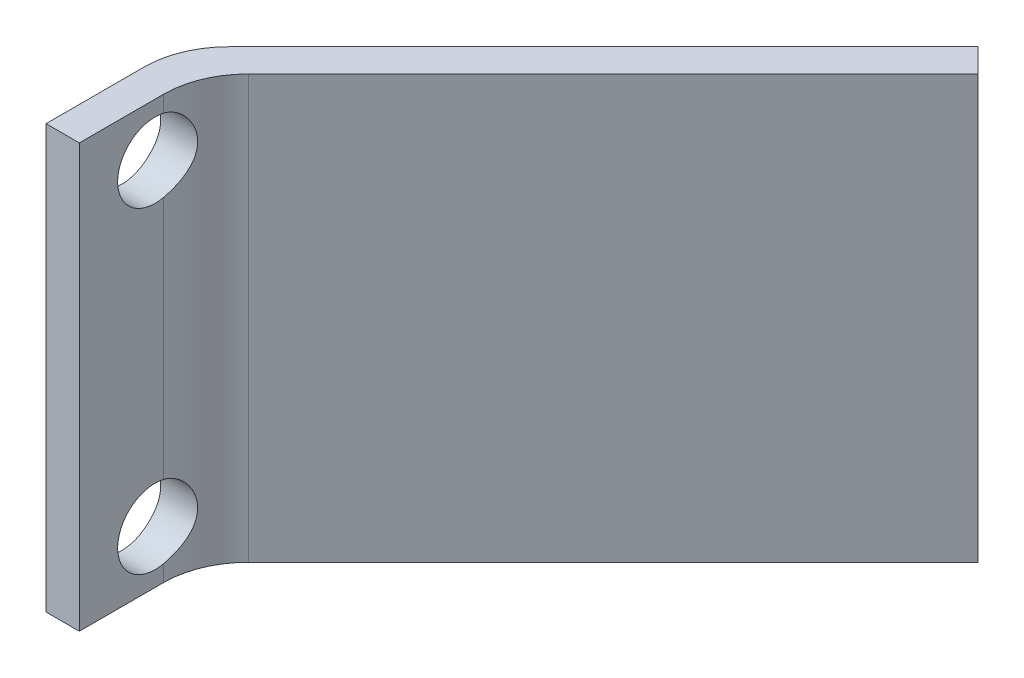
ISO-10303-21;
HEADER;
FILE_DESCRIPTION(('STEP AP214'),'2;1');
FILE_NAME('part.step','',(''),(''),'','','');
FILE_SCHEMA(('AUTOMOTIVE_DESIGN { 1 0 10303 214 1 1 1 1 }'));
ENDSEC;
DATA;
#1=APPLICATION_CONTEXT('core data for automotive mechanical design processes');
#2=APPLICATION_PROTOCOL_DEFINITION('international standard','automotive_design',2000,#1);
#3=PRODUCT_CONTEXT('',#1,'mechanical');
#4=PRODUCT('Part','Part','',(#3));
#5=PRODUCT_RELATED_PRODUCT_CATEGORY('part','',(#4));
#6=PRODUCT_DEFINITION_FORMATION('','',#4);
#7=PRODUCT_DEFINITION_CONTEXT('part definition',#1,'design');
#8=PRODUCT_DEFINITION('design','',#6,#7);
#9=PRODUCT_DEFINITION_SHAPE('','',#8);
#10=(LENGTH_UNIT() NAMED_UNIT(*) SI_UNIT(.MILLI.,.METRE.));
#11=(NAMED_UNIT(*) PLANE_ANGLE_UNIT() SI_UNIT($,.RADIAN.));
#12=(NAMED_UNIT(*) SI_UNIT($,.STERADIAN.) SOLID_ANGLE_UNIT());
#13=UNCERTAINTY_MEASURE_WITH_UNIT(LENGTH_MEASURE(1.E-05),#10,'distance_accuracy_value','');
#14=(GEOMETRIC_REPRESENTATION_CONTEXT(3) GLOBAL_UNCERTAINTY_ASSIGNED_CONTEXT((#13)) GLOBAL_UNIT_ASSIGNED_CONTEXT((#10,
#11,#12)) REPRESENTATION_CONTEXT('',''));
#15=CARTESIAN_POINT('',(0.,0.,0.));
#16=DIRECTION('',(0.,0.,1.));
#17=DIRECTION('',(1.,0.,0.));
#18=AXIS2_PLACEMENT_3D('',#15,#16,#17);
#19=CARTESIAN_POINT('',(1.,12.7,0.));
#20=DIRECTION('',(-1.,0.,0.));
#21=DIRECTION('',(0.,0.,1.));
#22=AXIS2_PLACEMENT_3D('',#19,#20,#21);
#23=PLANE('',#22);
#24=DIRECTION('',(0.,-1.,0.));
#25=VECTOR('',#24,1.);
#26=CARTESIAN_POINT('',(1.,12.7,-2.53368398919926));
#27=LINE('',#26,#25);
#28=CARTESIAN_POINT('',(1.,2.6827770228739,-2.53368398919926));
#29=VERTEX_POINT('',#28);
#30=CARTESIAN_POINT('',(1.,10.0172229771261,-2.53368398919926));
#31=VERTEX_POINT('',#30);
#32=EDGE_CURVE('E170',#29,#31,#27,.F.);
#33=ORIENTED_EDGE('',*,*,#32,.T.);
#34=CARTESIAN_POINT('',(1.,11.1125,-2.27679248843583));
#35=DIRECTION('',(-1.,0.,0.));
#36=DIRECTION('',(0.,0.,1.));
#37=AXIS2_PLACEMENT_3D('',#34,#35,#36);
#38=CIRCLE('',#37,1.125);
#39=CARTESIAN_POINT('',(1.,12.2077770228739,-2.53368398919926));
#40=VERTEX_POINT('',#39);
#41=EDGE_CURVE('E131',#31,#40,#38,.T.);
#42=ORIENTED_EDGE('',*,*,#41,.T.);
#43=CARTESIAN_POINT('',(1.,12.7,-2.53368398919926));
#44=VERTEX_POINT('',#43);
#45=EDGE_CURVE('E165',#40,#44,#27,.F.);
#46=ORIENTED_EDGE('',*,*,#45,.T.);
#47=DIRECTION('',(0.,0.,-1.));
#48=VECTOR('',#47,1.);
#49=CARTESIAN_POINT('',(1.,12.7,0.));
#50=LINE('',#49,#48);
#51=CARTESIAN_POINT('',(1.,12.7,0.));
#52=VERTEX_POINT('',#51);
#53=EDGE_CURVE('E229',#52,#44,#50,.T.);
#54=ORIENTED_EDGE('',*,*,#53,.F.);
#55=DIRECTION('',(0.,-1.,0.));
#56=VECTOR('',#55,1.);
#57=CARTESIAN_POINT('',(1.,12.7,0.));
#58=LINE('',#57,#56);
#59=CARTESIAN_POINT('',(1.,0.,0.));
#60=VERTEX_POINT('',#59);
#61=EDGE_CURVE('E145',#52,#60,#58,.T.);
#62=ORIENTED_EDGE('',*,*,#61,.T.);
#63=DIRECTION('',(0.,0.,-1.));
#64=VECTOR('',#63,1.);
#65=CARTESIAN_POINT('',(1.,0.,0.));
#66=LINE('',#65,#64);
#67=CARTESIAN_POINT('',(1.,0.,-2.53368398919926));
#68=VERTEX_POINT('',#67);
#69=EDGE_CURVE('E237',#60,#68,#66,.T.);
#70=ORIENTED_EDGE('',*,*,#69,.T.);
#71=CARTESIAN_POINT('',(1.,0.492222977126097,-2.53368398919926));
#72=VERTEX_POINT('',#71);
#73=EDGE_CURVE('E166',#68,#72,#27,.F.);
#74=ORIENTED_EDGE('',*,*,#73,.T.);
#75=CARTESIAN_POINT('',(1.,1.5875,-2.27679248843583));
#76=DIRECTION('',(-1.,0.,0.));
#77=DIRECTION('',(0.,0.,1.));
#78=AXIS2_PLACEMENT_3D('',#75,#76,#77);
#79=CIRCLE('',#78,1.125);
#80=EDGE_CURVE('E132',#72,#29,#79,.T.);
#81=ORIENTED_EDGE('',*,*,#80,.T.);
#82=EDGE_LOOP('',(#33,#42,#46,#54,#62,#70,#74,#81));
#83=FACE_BOUND('',#82,.T.);
#84=ADVANCED_FACE('F33',(#83),#23,.F.);
#85=CARTESIAN_POINT('',(0.,12.7,0.));
#86=DIRECTION('',(0.,0.,-1.));
#87=DIRECTION('',(-1.,0.,0.));
#88=AXIS2_PLACEMENT_3D('',#85,#86,#87);
#89=PLANE('',#88);
#90=DIRECTION('',(1.,0.,0.));
#91=VECTOR('',#90,1.);
#92=CARTESIAN_POINT('',(0.,0.,0.));
#93=LINE('',#92,#91);
#94=CARTESIAN_POINT('',(0.,0.,0.));
#95=VERTEX_POINT('',#94);
#96=EDGE_CURVE('E218',#95,#60,#93,.T.);
#97=ORIENTED_EDGE('',*,*,#96,.T.);
#98=ORIENTED_EDGE('',*,*,#61,.F.);
#99=DIRECTION('',(1.,0.,0.));
#100=VECTOR('',#99,1.);
#101=CARTESIAN_POINT('',(0.,12.7,0.));
#102=LINE('',#101,#100);
#103=CARTESIAN_POINT('',(0.,12.7,0.));
#104=VERTEX_POINT('',#103);
#105=EDGE_CURVE('E226',#104,#52,#102,.T.);
#106=ORIENTED_EDGE('',*,*,#105,.F.);
#107=DIRECTION('',(0.,-1.,0.));
#108=VECTOR('',#107,1.);
#109=CARTESIAN_POINT('',(0.,12.7,0.));
#110=LINE('',#109,#108);
#111=EDGE_CURVE('E149',#104,#95,#110,.T.);
#112=ORIENTED_EDGE('',*,*,#111,.T.);
#113=EDGE_LOOP('',(#97,#98,#106,#112));
#114=FACE_BOUND('',#113,.T.);
#115=ADVANCED_FACE('F196',(#114),#89,.F.);
#116=CARTESIAN_POINT('',(0.,12.7,0.));
#117=DIRECTION('',(1.,0.,0.));
#118=DIRECTION('',(0.,0.,-1.));
#119=AXIS2_PLACEMENT_3D('',#116,#117,#118);
#120=PLANE('',#119);
#121=DIRECTION('',(0.,-1.,0.));
#122=VECTOR('',#121,1.);
#123=CARTESIAN_POINT('',(0.,12.7,-2.94789755157235));
#124=LINE('',#123,#122);
#125=CARTESIAN_POINT('',(0.,12.7,-2.94789755157235));
#126=VERTEX_POINT('',#125);
#127=CARTESIAN_POINT('',(0.,12.0154080762916,-2.94789755157235));
#128=VERTEX_POINT('',#127);
#129=EDGE_CURVE('E147',#126,#128,#124,.T.);
#130=ORIENTED_EDGE('',*,*,#129,.T.);
#131=CARTESIAN_POINT('',(0.,11.1125,-2.27679248843583));
#132=DIRECTION('',(1.,0.,0.));
#133=DIRECTION('',(0.,0.,-1.));
#134=AXIS2_PLACEMENT_3D('',#131,#132,#133);
#135=CIRCLE('',#134,1.125);
#136=CARTESIAN_POINT('',(0.,10.2095919237084,-2.94789755157235));
#137=VERTEX_POINT('',#136);
#138=EDGE_CURVE('E59',#128,#137,#135,.T.);
#139=ORIENTED_EDGE('',*,*,#138,.T.);
#140=CARTESIAN_POINT('',(0.,2.49040807629157,-2.94789755157235));
#141=VERTEX_POINT('',#140);
#142=EDGE_CURVE('E139',#137,#141,#124,.T.);
#143=ORIENTED_EDGE('',*,*,#142,.T.);
#144=CARTESIAN_POINT('',(0.,1.5875,-2.27679248843583));
#145=DIRECTION('',(1.,0.,0.));
#146=DIRECTION('',(0.,0.,-1.));
#147=AXIS2_PLACEMENT_3D('',#144,#145,#146);
#148=CIRCLE('',#147,1.125);
#149=CARTESIAN_POINT('',(0.,0.684591923708432,-2.94789755157235));
#150=VERTEX_POINT('',#149);
#151=EDGE_CURVE('E52',#141,#150,#148,.T.);
#152=ORIENTED_EDGE('',*,*,#151,.T.);
#153=CARTESIAN_POINT('',(0.,0.,-2.94789755157235));
#154=VERTEX_POINT('',#153);
#155=EDGE_CURVE('E137',#150,#154,#124,.T.);
#156=ORIENTED_EDGE('',*,*,#155,.T.);
#157=DIRECTION('',(0.,0.,1.));
#158=VECTOR('',#157,1.);
#159=CARTESIAN_POINT('',(0.,0.,0.));
#160=LINE('',#159,#158);
#161=EDGE_CURVE('E230',#154,#95,#160,.T.);
#162=ORIENTED_EDGE('',*,*,#161,.T.);
#163=ORIENTED_EDGE('',*,*,#111,.F.);
#164=DIRECTION('',(0.,0.,1.));
#165=VECTOR('',#164,1.);
#166=CARTESIAN_POINT('',(0.,12.7,0.));
#167=LINE('',#166,#165);
#168=EDGE_CURVE('E233',#126,#104,#167,.T.);
#169=ORIENTED_EDGE('',*,*,#168,.F.);
#170=EDGE_LOOP('',(#130,#139,#143,#152,#156,#162,#163,#169));
#171=FACE_BOUND('',#170,.T.);
#172=ADVANCED_FACE('F136',(#171),#120,.F.);
#173=CARTESIAN_POINT('',(0.,12.7,0.));
#174=DIRECTION('',(0.,1.,0.));
#175=DIRECTION('',(0.,0.,1.));
#176=AXIS2_PLACEMENT_3D('',#173,#174,#175);
#177=PLANE('',#176);
#178=DIRECTION('',(-0.707106781186543,0.,0.707106781186552));
#179=VECTOR('',#178,1.);
#180=CARTESIAN_POINT('',(0.,12.7,-4.));
#181=LINE('',#180,#179);
#182=CARTESIAN_POINT('',(11.9928932188134,12.7,-15.9928932188136));
#183=VERTEX_POINT('',#182);
#184=CARTESIAN_POINT('',(0.743948775786159,12.7,-4.74394877578617));
#185=VERTEX_POINT('',#184);
#186=EDGE_CURVE('E208',#183,#185,#181,.T.);
#187=ORIENTED_EDGE('',*,*,#186,.T.);
#188=CARTESIAN_POINT('',(2.54,12.7,-2.94789755157235));
#189=DIRECTION('',(0.,1.,0.));
#190=DIRECTION('',(0.,0.,1.));
#191=AXIS2_PLACEMENT_3D('',#188,#189,#190);
#192=CIRCLE('',#191,2.54);
#193=EDGE_CURVE('E158',#185,#126,#192,.T.);
#194=ORIENTED_EDGE('',*,*,#193,.T.);
#195=ORIENTED_EDGE('',*,*,#168,.T.);
#196=ORIENTED_EDGE('',*,*,#105,.T.);
#197=ORIENTED_EDGE('',*,*,#53,.T.);
#198=CARTESIAN_POINT('',(3.54,12.7,-2.53368398919926));
#199=DIRECTION('',(0.,1.,0.));
#200=DIRECTION('',(0.,0.,1.));
#201=AXIS2_PLACEMENT_3D('',#198,#199,#200);
#202=CIRCLE('',#201,2.54);
#203=CARTESIAN_POINT('',(1.74394877578616,12.7,-4.32973521341308));
#204=VERTEX_POINT('',#203);
#205=EDGE_CURVE('E172',#44,#204,#202,.F.);
#206=ORIENTED_EDGE('',*,*,#205,.T.);
#207=DIRECTION('',(0.707106781186543,0.,-0.707106781186552));
#208=VECTOR('',#207,1.);
#209=CARTESIAN_POINT('',(0.707106781186552,12.7,-3.29289321881346));
#210=LINE('',#209,#208);
#211=CARTESIAN_POINT('',(12.7,12.7,-15.285786437627));
#212=VERTEX_POINT('',#211);
#213=EDGE_CURVE('E219',#204,#212,#210,.T.);
#214=ORIENTED_EDGE('',*,*,#213,.T.);
#215=DIRECTION('',(-0.707106781186551,0.,-0.707106781186544));
#216=VECTOR('',#215,1.);
#217=CARTESIAN_POINT('',(11.9928932188134,12.7,-15.9928932188136));
#218=LINE('',#217,#216);
#219=EDGE_CURVE('E215',#212,#183,#218,.T.);
#220=ORIENTED_EDGE('',*,*,#219,.T.);
#221=EDGE_LOOP('',(#187,#194,#195,#196,#197,#206,#214,#220));
#222=FACE_BOUND('',#221,.T.);
#223=ADVANCED_FACE('F256',(#222),#177,.T.);
#224=CARTESIAN_POINT('',(0.,0.,0.));
#225=DIRECTION('',(0.,1.,0.));
#226=DIRECTION('',(0.,0.,1.));
#227=AXIS2_PLACEMENT_3D('',#224,#225,#226);
#228=PLANE('',#227);
#229=ORIENTED_EDGE('',*,*,#161,.F.);
#230=CARTESIAN_POINT('',(2.54,0.,-2.94789755157235));
#231=DIRECTION('',(0.,1.,0.));
#232=DIRECTION('',(0.,0.,1.));
#233=AXIS2_PLACEMENT_3D('',#230,#231,#232);
#234=CIRCLE('',#233,2.54);
#235=CARTESIAN_POINT('',(0.743948775786159,0.,-4.74394877578617));
#236=VERTEX_POINT('',#235);
#237=EDGE_CURVE('E143',#154,#236,#234,.F.);
#238=ORIENTED_EDGE('',*,*,#237,.T.);
#239=DIRECTION('',(-0.707106781186543,0.,0.707106781186552));
#240=VECTOR('',#239,1.);
#241=CARTESIAN_POINT('',(0.,0.,-4.));
#242=LINE('',#241,#240);
#243=CARTESIAN_POINT('',(11.9928932188134,0.,-15.9928932188136));
#244=VERTEX_POINT('',#243);
#245=EDGE_CURVE('E206',#244,#236,#242,.T.);
#246=ORIENTED_EDGE('',*,*,#245,.F.);
#247=DIRECTION('',(-0.707106781186551,0.,-0.707106781186544));
#248=VECTOR('',#247,1.);
#249=CARTESIAN_POINT('',(11.9928932188134,0.,-15.9928932188136));
#250=LINE('',#249,#248);
#251=CARTESIAN_POINT('',(12.7,0.,-15.285786437627));
#252=VERTEX_POINT('',#251);
#253=EDGE_CURVE('E210',#252,#244,#250,.T.);
#254=ORIENTED_EDGE('',*,*,#253,.F.);
#255=DIRECTION('',(0.707106781186543,0.,-0.707106781186552));
#256=VECTOR('',#255,1.);
#257=CARTESIAN_POINT('',(0.707106781186552,0.,-3.29289321881346));
#258=LINE('',#257,#256);
#259=CARTESIAN_POINT('',(1.74394877578616,0.,-4.32973521341308));
#260=VERTEX_POINT('',#259);
#261=EDGE_CURVE('E205',#260,#252,#258,.T.);
#262=ORIENTED_EDGE('',*,*,#261,.F.);
#263=CARTESIAN_POINT('',(3.54,0.,-2.53368398919926));
#264=DIRECTION('',(0.,1.,0.));
#265=DIRECTION('',(0.,0.,1.));
#266=AXIS2_PLACEMENT_3D('',#263,#264,#265);
#267=CIRCLE('',#266,2.54);
#268=EDGE_CURVE('E169',#260,#68,#267,.T.);
#269=ORIENTED_EDGE('',*,*,#268,.T.);
#270=ORIENTED_EDGE('',*,*,#69,.F.);
#271=ORIENTED_EDGE('',*,*,#96,.F.);
#272=EDGE_LOOP('',(#229,#238,#246,#254,#262,#269,#270,#271));
#273=FACE_BOUND('',#272,.T.);
#274=ADVANCED_FACE('F247',(#273),#228,.F.);
#275=CARTESIAN_POINT('',(0.707106781186552,30.6605122421384,-3.29289321881346));
#276=DIRECTION('',(-0.707106781186552,0.,-0.707106781186543));
#277=DIRECTION('',(-0.707106781186543,0.,0.707106781186552));
#278=AXIS2_PLACEMENT_3D('',#275,#276,#277);
#279=PLANE('',#278);
#280=ORIENTED_EDGE('',*,*,#213,.F.);
#281=DIRECTION('',(0.,-1.,0.));
#282=VECTOR('',#281,1.);
#283=CARTESIAN_POINT('',(1.74394877578616,0.,-4.32973521341308));
#284=LINE('',#283,#282);
#285=EDGE_CURVE('E162',#204,#260,#284,.T.);
#286=ORIENTED_EDGE('',*,*,#285,.T.);
#287=ORIENTED_EDGE('',*,*,#261,.T.);
#288=DIRECTION('',(0.,-1.,0.));
#289=VECTOR('',#288,1.);
#290=CARTESIAN_POINT('',(12.7,30.6605122421384,-15.285786437627));
#291=LINE('',#290,#289);
#292=EDGE_CURVE('E213',#212,#252,#291,.T.);
#293=ORIENTED_EDGE('',*,*,#292,.F.);
#294=EDGE_LOOP('',(#280,#286,#287,#293));
#295=FACE_BOUND('',#294,.T.);
#296=ADVANCED_FACE('F275',(#295),#279,.F.);
#297=CARTESIAN_POINT('',(11.9928932188134,30.6605122421384,-15.9928932188136));
#298=DIRECTION('',(-0.707106781186544,0.,0.707106781186551));
#299=DIRECTION('',(0.707106781186551,0.,0.707106781186544));
#300=AXIS2_PLACEMENT_3D('',#297,#298,#299);
#301=PLANE('',#300);
#302=ORIENTED_EDGE('',*,*,#219,.F.);
#303=ORIENTED_EDGE('',*,*,#292,.T.);
#304=ORIENTED_EDGE('',*,*,#253,.T.);
#305=DIRECTION('',(0.,-1.,0.));
#306=VECTOR('',#305,1.);
#307=CARTESIAN_POINT('',(11.9928932188134,30.6605122421384,-15.9928932188136));
#308=LINE('',#307,#306);
#309=EDGE_CURVE('E209',#183,#244,#308,.T.);
#310=ORIENTED_EDGE('',*,*,#309,.F.);
#311=EDGE_LOOP('',(#302,#303,#304,#310));
#312=FACE_BOUND('',#311,.T.);
#313=ADVANCED_FACE('F279',(#312),#301,.F.);
#314=CARTESIAN_POINT('',(0.,30.6605122421384,-4.));
#315=DIRECTION('',(0.707106781186552,0.,0.707106781186543));
#316=DIRECTION('',(0.707106781186543,0.,-0.707106781186552));
#317=AXIS2_PLACEMENT_3D('',#314,#315,#316);
#318=PLANE('',#317);
#319=ORIENTED_EDGE('',*,*,#245,.T.);
#320=DIRECTION('',(0.,-1.,0.));
#321=VECTOR('',#320,1.);
#322=CARTESIAN_POINT('',(0.743948775786159,30.6605122421384,-4.74394877578617));
#323=LINE('',#322,#321);
#324=EDGE_CURVE('E154',#236,#185,#323,.F.);
#325=ORIENTED_EDGE('',*,*,#324,.T.);
#326=ORIENTED_EDGE('',*,*,#186,.F.);
#327=ORIENTED_EDGE('',*,*,#309,.T.);
#328=EDGE_LOOP('',(#319,#325,#326,#327));
#329=FACE_BOUND('',#328,.T.);
#330=ADVANCED_FACE('F183',(#329),#318,.F.);
#331=CARTESIAN_POINT('',(2.54,12.7,-2.94789755157235));
#332=DIRECTION('',(0.,-1.,0.));
#333=DIRECTION('',(0.,0.,-1.));
#334=AXIS2_PLACEMENT_3D('',#331,#332,#333);
#335=CYLINDRICAL_SURFACE('',#334,2.54);
#336=CARTESIAN_POINT('',(0.,12.0154080762916,-2.94789755157235));
#337=CARTESIAN_POINT('',(-7.47759486069675E-07,11.9966287653107,-2.97316384153478));
#338=CARTESIAN_POINT('',(0.000377077206767993,11.9767987342781,-2.99762641538728));
#339=CARTESIAN_POINT('',(0.00173930482454676,11.9351747032471,-3.04479052675431));
#340=CARTESIAN_POINT('',(0.00272355002276702,11.9133812143023,-3.06749251967081));
#341=CARTESIAN_POINT('',(0.00635611839449045,11.8453288971945,-3.13266721369326));
#342=CARTESIAN_POINT('',(0.00968537006441408,11.7963288601555,-3.17230169430081));
#343=CARTESIAN_POINT('',(0.0169283544181939,11.692485804935,-3.24280752076252));
#344=CARTESIAN_POINT('',(0.0208419310587344,11.6376443478154,-3.27368119981349));
#345=CARTESIAN_POINT('',(0.0281433530884983,11.523554914026,-3.32588299073555));
#346=CARTESIAN_POINT('',(0.0315312550680762,11.4643074126965,-3.34721213056949));
#347=CARTESIAN_POINT('',(0.0369426925382699,11.3424937112424,-3.37985110693401));
#348=CARTESIAN_POINT('',(0.0389540944348367,11.27990311135,-3.39107210874257));
#349=CARTESIAN_POINT('',(0.0410642173157234,11.1536915588728,-3.40282272696684));
#350=CARTESIAN_POINT('',(0.041162984413882,11.0900706311663,-3.40335260114685));
#351=CARTESIAN_POINT('',(0.0394380867220043,10.9646584427495,-3.39378062327732));
#352=CARTESIAN_POINT('',(0.0376441668395437,10.9028541049848,-3.38384327497398));
#353=CARTESIAN_POINT('',(0.0326115968099733,10.7817858800799,-3.35389166342459));
#354=CARTESIAN_POINT('',(0.0293725774800311,10.7225226463649,-3.33387482498012));
#355=CARTESIAN_POINT('',(0.0222344919757513,10.607799238012,-3.28418375514946));
#356=CARTESIAN_POINT('',(0.0183313710866621,10.5523655584506,-3.25444909725883));
#357=CARTESIAN_POINT('',(0.0109684185026699,10.4472274537843,-3.18616468908686));
#358=CARTESIAN_POINT('',(0.00750816075642793,10.3975175269016,-3.14762351199088));
#359=CARTESIAN_POINT('',(0.00339254946875228,10.3253256119137,-3.08130183092526));
#360=CARTESIAN_POINT('',(0.00217197195659593,10.3004168038005,-3.05614896944394));
#361=CARTESIAN_POINT('',(0.000475528625308387,10.2530954207823,-3.0036327468898));
#362=CARTESIAN_POINT('',(-1.30028493352368E-06,10.2306796526132,-2.97627229285581));
#363=CARTESIAN_POINT('',(0.,10.2095919237084,-2.94789755157235));
#364=B_SPLINE_CURVE_WITH_KNOTS('',3,(#336,#337,#338,#339,#340,#341,#342,#343,#344,#345,#346,
#347,#348,#349,#350,#351,#352,#353,#354,#355,#356,#357,#358,#359,#360,#361,#362,#363),
.UNSPECIFIED.,.F.,.F.,(4,2,2,2,2,2,2,2,2,2,2,2,2,4),(0.,0.0943783787205218,0.188732262992819,
0.377096361516361,0.565410247296305,0.75370384647093,0.943636549182412,1.13356467258952,
1.32055178545803,1.50758669572621,1.69580747141049,1.8838457881648,1.98995891575301,
2.09593452146367),.UNSPECIFIED.);
#365=EDGE_CURVE('E199',#128,#137,#364,.T.);
#366=ORIENTED_EDGE('',*,*,#365,.F.);
#367=ORIENTED_EDGE('',*,*,#129,.F.);
#368=ORIENTED_EDGE('',*,*,#193,.F.);
#369=ORIENTED_EDGE('',*,*,#324,.F.);
#370=ORIENTED_EDGE('',*,*,#237,.F.);
#371=ORIENTED_EDGE('',*,*,#155,.F.);
#372=CARTESIAN_POINT('',(0.,2.49040807629157,-2.94789755157235));
#373=CARTESIAN_POINT('',(-7.47759486465435E-07,2.47162876531075,-2.97316384153478));
#374=CARTESIAN_POINT('',(0.00037707720676755,2.45179873427811,-2.99762641538728));
#375=CARTESIAN_POINT('',(0.00173930482454647,2.41017470324712,-3.04479052675431));
#376=CARTESIAN_POINT('',(0.00272355002276692,2.38838121430226,-3.06749251967081));
#377=CARTESIAN_POINT('',(0.00635611839449064,2.32032889719449,-3.13266721369326));
#378=CARTESIAN_POINT('',(0.00968537006441407,2.27132886015548,-3.17230169430081));
#379=CARTESIAN_POINT('',(0.016928354418194,2.16748580493505,-3.24280752076252));
#380=CARTESIAN_POINT('',(0.0208419310587348,2.11264434781543,-3.2736811998135));
#381=CARTESIAN_POINT('',(0.0281433530884988,1.99855491402599,-3.32588299073555));
#382=CARTESIAN_POINT('',(0.0315312550680766,1.93930741269646,-3.3472121305695));
#383=CARTESIAN_POINT('',(0.03694269253827,1.81749371124241,-3.37985110693402));
#384=CARTESIAN_POINT('',(0.0389540944348367,1.75490311135005,-3.39107210874257));
#385=CARTESIAN_POINT('',(0.0410642173157238,1.62869155887281,-3.40282272696685));
#386=CARTESIAN_POINT('',(0.0411629844138829,1.56507063116626,-3.40335260114686));
#387=CARTESIAN_POINT('',(0.0394380867220052,1.43965844274952,-3.39378062327732));
#388=CARTESIAN_POINT('',(0.0376441668395444,1.37785410498476,-3.38384327497398));
#389=CARTESIAN_POINT('',(0.0326115968099739,1.25678588007995,-3.3538916634246));
#390=CARTESIAN_POINT('',(0.029372577480032,1.19752264636488,-3.33387482498013));
#391=CARTESIAN_POINT('',(0.0222344919757524,1.08279923801202,-3.28418375514946));
#392=CARTESIAN_POINT('',(0.0183313710866631,1.02736555845057,-3.25444909725883));
#393=CARTESIAN_POINT('',(0.0109684185026706,0.922227453784296,-3.18616468908687));
#394=CARTESIAN_POINT('',(0.00750816075642848,0.872517526901647,-3.14762351199088));
#395=CARTESIAN_POINT('',(0.00339254946875254,0.800325611913683,-3.08130183092526));
#396=CARTESIAN_POINT('',(0.00217197195659606,0.775416803800471,-3.05614896944395));
#397=CARTESIAN_POINT('',(0.000475528625308372,0.728095420782275,-3.0036327468898));
#398=CARTESIAN_POINT('',(-1.30028493356504E-06,0.705679652613148,-2.97627229285581));
#399=CARTESIAN_POINT('',(0.,0.684591923708431,-2.94789755157235));
#400=B_SPLINE_CURVE_WITH_KNOTS('',3,(#372,#373,#374,#375,#376,#377,#378,#379,#380,#381,#382,
#383,#384,#385,#386,#387,#388,#389,#390,#391,#392,#393,#394,#395,#396,#397,#398,#399),
.UNSPECIFIED.,.F.,.F.,(4,2,2,2,2,2,2,2,2,2,2,2,2,4),(0.,0.094378378720521,0.188732262992817,
0.377096361516361,0.565410247296304,0.753703846470928,0.94363654918241,1.13356467258952,
1.32055178545803,1.50758669572621,1.69580747141049,1.88384578816479,1.98995891575302,
2.09593452146368),.UNSPECIFIED.);
#401=EDGE_CURVE('E124',#141,#150,#400,.T.);
#402=ORIENTED_EDGE('',*,*,#401,.F.);
#403=ORIENTED_EDGE('',*,*,#142,.F.);
#404=EDGE_LOOP('',(#366,#367,#368,#369,#370,#371,#402,#403));
#405=FACE_BOUND('',#404,.T.);
#406=ADVANCED_FACE('F141',(#405),#335,.T.);
#407=CARTESIAN_POINT('',(3.54,30.6605122421384,-2.53368398919926));
#408=DIRECTION('',(0.,1.,0.));
#409=DIRECTION('',(0.,0.,1.));
#410=AXIS2_PLACEMENT_3D('',#407,#408,#409);
#411=CYLINDRICAL_SURFACE('',#410,2.54);
#412=ORIENTED_EDGE('',*,*,#45,.F.);
#413=CARTESIAN_POINT('',(1.15295420371682,11.1125,-3.40179248843583));
#414=CARTESIAN_POINT('',(1.15294807293612,11.0512533505484,-3.40178573799334));
#415=CARTESIAN_POINT('',(1.15110671541846,10.989932088672,-3.39676455274914));
#416=CARTESIAN_POINT('',(1.14400668887585,10.8690200239575,-3.37684497650822));
#417=CARTESIAN_POINT('',(1.13873976858244,10.8094337632883,-3.36192273474808));
#418=CARTESIAN_POINT('',(1.12559978905523,10.6939148426765,-3.3227932351397));
#419=CARTESIAN_POINT('',(1.11773482523916,10.637971471806,-3.29861478260634));
#420=CARTESIAN_POINT('',(1.10049451104973,10.5309100885206,-3.24170466076433));
#421=CARTESIAN_POINT('',(1.09111946948904,10.4797910928978,-3.2089747393915));
#422=CARTESIAN_POINT('',(1.07172783821672,10.381605855089,-3.13432872301938));
#423=CARTESIAN_POINT('',(1.0617005024282,10.3347767334492,-3.09210306969766));
#424=CARTESIAN_POINT('',(1.04278550792472,10.248701557066,-3.00028224420575));
#425=CARTESIAN_POINT('',(1.03389802756378,10.2094566885504,-2.95068592135604));
#426=CARTESIAN_POINT('',(1.01854907864657,10.1393085625153,-2.8447700500752));
#427=CARTESIAN_POINT('',(1.01211433783093,10.1084981827081,-2.78838477898789));
#428=CARTESIAN_POINT('',(1.00302917529672,10.0568565697381,-2.67093827250382));
#429=CARTESIAN_POINT('',(1.00037669306172,10.0360199071608,-2.60987960222258));
#430=CARTESIAN_POINT('',(0.999718900393655,10.0060236149965,-2.48888071531644));
#431=CARTESIAN_POINT('',(1.00144043268197,9.99623017122202,-2.42909881366994));
#432=CARTESIAN_POINT('',(1.00924001287884,9.98635059108916,-2.30902874140657));
#433=CARTESIAN_POINT('',(1.01531718122756,9.98626249542693,-2.24874067543126));
#434=CARTESIAN_POINT('',(1.03134158523779,9.99540900645588,-2.13169168708569));
#435=CARTESIAN_POINT('',(1.04113869539142,10.00430178557,-2.07488250098162));
#436=CARTESIAN_POINT('',(1.06408019788731,10.0303795160331,-1.96391708324606));
#437=CARTESIAN_POINT('',(1.07722524810339,10.0475660977178,-1.90976137552265));
#438=CARTESIAN_POINT('',(1.10684305272206,10.0906382198508,-1.80251958591692));
#439=CARTESIAN_POINT('',(1.12345315231611,10.1169291007656,-1.74963504533075));
#440=CARTESIAN_POINT('',(1.15844328500723,10.1771029283958,-1.6490201936617));
#441=CARTESIAN_POINT('',(1.1768241902932,10.2109896273534,-1.60129244730127));
#442=CARTESIAN_POINT('',(1.21598602776105,10.2893007036732,-1.50733241092965));
#443=CARTESIAN_POINT('',(1.23682457054993,10.3344356944476,-1.46171454291099));
#444=CARTESIAN_POINT('',(1.27738596966822,10.4321230655462,-1.37855518173356));
#445=CARTESIAN_POINT('',(1.29710803306022,10.4846806271423,-1.34101937680423));
#446=CARTESIAN_POINT('',(1.33390689333823,10.5978130863092,-1.27422034774933));
#447=CARTESIAN_POINT('',(1.35089756758305,10.6585665878504,-1.245208743581));
#448=CARTESIAN_POINT('',(1.37920112297961,10.7854207143981,-1.19827689201248));
#449=CARTESIAN_POINT('',(1.39052417315415,10.8515115137326,-1.18033676625509));
#450=CARTESIAN_POINT('',(1.40459495931393,10.9780156763764,-1.1582587750947));
#451=CARTESIAN_POINT('',(1.40825693266963,11.038068721023,-1.15264472161559));
#452=CARTESIAN_POINT('',(1.40924290385856,11.158340031491,-1.15112191908954));
#453=CARTESIAN_POINT('',(1.40656989569194,11.2185582058338,-1.15520858534935));
#454=CARTESIAN_POINT('',(1.39593986420352,11.3304348967663,-1.17181622429952));
#455=CARTESIAN_POINT('',(1.38859861772379,11.3823045777679,-1.18335649092459));
#456=CARTESIAN_POINT('',(1.37006754130363,11.4832748804367,-1.21334231404645));
#457=CARTESIAN_POINT('',(1.3588765390521,11.5323746533159,-1.23178997410458));
#458=CARTESIAN_POINT('',(1.33272957802189,11.6305305481413,-1.27659339082291));
#459=CARTESIAN_POINT('',(1.31755238443058,11.6793007061915,-1.30344295974928));
#460=CARTESIAN_POINT('',(1.28527281837499,11.7719370911222,-1.3636529849705));
#461=CARTESIAN_POINT('',(1.26816935054282,11.8158004992556,-1.39701715375753));
#462=CARTESIAN_POINT('',(1.23065606360164,11.9042310513495,-1.47506615169328));
#463=CARTESIAN_POINT('',(1.21013482124929,11.9479188690457,-1.52069817028334));
#464=CARTESIAN_POINT('',(1.16987555650478,12.0272222087648,-1.61884783641268));
#465=CARTESIAN_POINT('',(1.15013791757837,12.0628338178059,-1.67136880232928));
#466=CARTESIAN_POINT('',(1.11209550188281,12.126467488446,-1.78493360756316));
#467=CARTESIAN_POINT('',(1.09390236964696,12.1540518497624,-1.84626276267756));
#468=CARTESIAN_POINT('',(1.06160091694605,12.1980277486811,-1.97381529815903));
#469=CARTESIAN_POINT('',(1.04748947820673,12.2144278437553,-2.04003489358477));
#470=CARTESIAN_POINT('',(1.02544165736521,12.2341358771726,-2.16960741966342));
#471=CARTESIAN_POINT('',(1.01708929704672,12.238419276679,-2.23274068979363));
#472=CARTESIAN_POINT('',(1.00520037658404,12.2362526123511,-2.35926820213658));
#473=CARTESIAN_POINT('',(1.00166145255424,12.2298078206083,-2.42266230090169));
#474=CARTESIAN_POINT('',(0.99936342456788,12.2072236474194,-2.5425552483384));
#475=CARTESIAN_POINT('',(1.00024759073288,12.1918934342995,-2.59920227863492));
#476=CARTESIAN_POINT('',(1.00547773323294,12.1526887861816,-2.70928084411911));
#477=CARTESIAN_POINT('',(1.00982393325952,12.1288137991372,-2.76271217129142));
#478=CARTESIAN_POINT('',(1.02125303195004,12.0728589905776,-2.86570551635124));
#479=CARTESIAN_POINT('',(1.02837238403383,12.0406718890348,-2.91520495132821));
#480=CARTESIAN_POINT('',(1.04430869134639,11.9691307813759,-3.00840901389701));
#481=CARTESIAN_POINT('',(1.05312610166649,11.9297748541185,-3.05211208270832));
#482=CARTESIAN_POINT('',(1.07191977806379,11.8420379815036,-3.13545104511313));
#483=CARTESIAN_POINT('',(1.08193411866328,11.7932357795464,-3.17463565151894));
#484=CARTESIAN_POINT('',(1.10120847615211,11.6896761845489,-3.24446734755947));
#485=CARTESIAN_POINT('',(1.11046798279275,11.634914820704,-3.27510869548062));
#486=CARTESIAN_POINT('',(1.12708417463585,11.519506061073,-3.32754408127611));
#487=CARTESIAN_POINT('',(1.13439338716204,11.4587539944615,-3.34912366784116));
#488=CARTESIAN_POINT('',(1.14563629024999,11.3342735721638,-3.38157976806183));
#489=CARTESIAN_POINT('',(1.14957942140227,11.2705540725777,-3.39248622849254));
#490=CARTESIAN_POINT('',(1.15247975050092,11.1751732339727,-3.40048589136047));
#491=CARTESIAN_POINT('',(1.15295734148581,11.143846389168,-3.40179594335132));
#492=CARTESIAN_POINT('',(1.15295420371682,11.1125,-3.40179248843583));
#493=B_SPLINE_CURVE_WITH_KNOTS('',3,(#413,#414,#415,#416,#417,#418,#419,#420,#421,#422,#423,
#424,#425,#426,#427,#428,#429,#430,#431,#432,#433,#434,#435,#436,#437,#438,#439,#440,#441,#442,
#443,#444,#445,#446,#447,#448,#449,#450,#451,#452,#453,#454,#455,#456,#457,#458,#459,#460,#461,
#462,#463,#464,#465,#466,#467,#468,#469,#470,#471,#472,#473,#474,#475,#476,#477,#478,#479,#480,
#481,#482,#483,#484,#485,#486,#487,#488,#489,#490,#491,#492),.UNSPECIFIED.,.T.,.F.,(4,2,2,2,2,2,
2,2,2,2,2,2,2,2,2,2,2,2,2,2,2,2,2,2,2,2,2,2,2,2,2,2,2,2,2,2,2,2,2,4),(0.,0.183642065717289,
0.367728122731235,0.551245900832204,0.734726196871075,0.925392115478284,1.11608783141751,
1.30880590064879,1.50141893986939,1.68230264374077,1.86314983096338,2.03736374950278,
2.21161192771118,2.39490757943969,2.57829397733017,2.77981202801768,2.98147144866358,
3.18859322453095,3.39534203203545,3.57554994027953,3.75567269675184,3.91591472989309,
4.07620560250842,4.24865819692529,4.42120935570324,4.61961490991732,4.81811638866994,
5.02598961449577,5.23370361028286,5.42414143124053,5.6144856940958,5.78973815499309,
5.96500194035267,6.14265186954384,6.32034947656866,6.50963885964943,6.69905515448188,
6.89273099405798,7.08586184431817,7.17985091492243),.UNSPECIFIED.);
#494=EDGE_CURVE('E11',#40,#31,#493,.T.);
#495=ORIENTED_EDGE('',*,*,#494,.T.);
#496=ORIENTED_EDGE('',*,*,#32,.F.);
#497=CARTESIAN_POINT('',(1.15295420371682,1.5875,-3.40179248843583));
#498=CARTESIAN_POINT('',(1.15294807293612,1.52625335054838,-3.40178573799334));
#499=CARTESIAN_POINT('',(1.15110671541846,1.46493208867203,-3.39676455274915));
#500=CARTESIAN_POINT('',(1.14400668887586,1.34402002395751,-3.37684497650822));
#501=CARTESIAN_POINT('',(1.13873976858244,1.28443376328829,-3.36192273474808));
#502=CARTESIAN_POINT('',(1.12559978905524,1.16891484267649,-3.3227932351397));
#503=CARTESIAN_POINT('',(1.11773482523916,1.11297147180604,-3.29861478260634));
#504=CARTESIAN_POINT('',(1.10049451104973,1.00591008852059,-3.24170466076433));
#505=CARTESIAN_POINT('',(1.09111946948904,0.954791092897756,-3.2089747393915));
#506=CARTESIAN_POINT('',(1.07172783821672,0.856605855089029,-3.13432872301938));
#507=CARTESIAN_POINT('',(1.0617005024282,0.8097767334492,-3.09210306969767));
#508=CARTESIAN_POINT('',(1.04278550792472,0.723701557065949,-3.00028224420575));
#509=CARTESIAN_POINT('',(1.03389802756378,0.68445668855043,-2.95068592135604));
#510=CARTESIAN_POINT('',(1.01854907864657,0.614308562515251,-2.8447700500752));
#511=CARTESIAN_POINT('',(1.01211433783093,0.583498182708067,-2.78838477898789));
#512=CARTESIAN_POINT('',(1.00302917529672,0.531856569738056,-2.67093827250383));
#513=CARTESIAN_POINT('',(1.00037669306172,0.511019907160762,-2.60987960222258));
#514=CARTESIAN_POINT('',(0.999718900393655,0.481023614996512,-2.48888071531644));
#515=CARTESIAN_POINT('',(1.00144043268197,0.471230171222017,-2.42909881366994));
#516=CARTESIAN_POINT('',(1.00924001287884,0.461350591089154,-2.30902874140657));
#517=CARTESIAN_POINT('',(1.01531718122756,0.46126249542693,-2.24874067543127));
#518=CARTESIAN_POINT('',(1.03134158523779,0.47040900645588,-2.13169168708569));
#519=CARTESIAN_POINT('',(1.04113869539142,0.479301785570005,-2.07488250098162));
#520=CARTESIAN_POINT('',(1.06408019788731,0.505379516033139,-1.96391708324606));
#521=CARTESIAN_POINT('',(1.07722524810339,0.522566097717804,-1.90976137552265));
#522=CARTESIAN_POINT('',(1.10684305272206,0.565638219850793,-1.80251958591692));
#523=CARTESIAN_POINT('',(1.12345315231611,0.591929100765575,-1.74963504533075));
#524=CARTESIAN_POINT('',(1.15844328500723,0.652102928395777,-1.6490201936617));
#525=CARTESIAN_POINT('',(1.1768241902932,0.685989627353348,-1.60129244730127));
#526=CARTESIAN_POINT('',(1.21598602776105,0.764300703673201,-1.50733241092965));
#527=CARTESIAN_POINT('',(1.23682457054993,0.809435694447607,-1.461714542911));
#528=CARTESIAN_POINT('',(1.27738596966822,0.907123065546226,-1.37855518173357));
#529=CARTESIAN_POINT('',(1.29710803306022,0.959680627142317,-1.34101937680424));
#530=CARTESIAN_POINT('',(1.33390689333823,1.07281308630921,-1.27422034774933));
#531=CARTESIAN_POINT('',(1.35089756758305,1.13356658785043,-1.245208743581));
#532=CARTESIAN_POINT('',(1.37920112297961,1.26042071439813,-1.19827689201249));
#533=CARTESIAN_POINT('',(1.39052417315415,1.32651151373257,-1.1803367662551));
#534=CARTESIAN_POINT('',(1.40459495931393,1.45301567637644,-1.1582587750947));
#535=CARTESIAN_POINT('',(1.40825693266962,1.51306872102298,-1.15264472161559));
#536=CARTESIAN_POINT('',(1.40924290385856,1.63334003149095,-1.15112191908954));
#537=CARTESIAN_POINT('',(1.40656989569194,1.6935582058338,-1.15520858534935));
#538=CARTESIAN_POINT('',(1.39593986420352,1.80543489676625,-1.17181622429953));
#539=CARTESIAN_POINT('',(1.38859861772379,1.85730457776788,-1.18335649092459));
#540=CARTESIAN_POINT('',(1.37006754130363,1.95827488043668,-1.21334231404646));
#541=CARTESIAN_POINT('',(1.3588765390521,2.00737465331587,-1.23178997410458));
#542=CARTESIAN_POINT('',(1.33272957802189,2.10553054814125,-1.27659339082291));
#543=CARTESIAN_POINT('',(1.31755238443058,2.15430070619146,-1.30344295974929));
#544=CARTESIAN_POINT('',(1.28527281837499,2.2469370911222,-1.3636529849705));
#545=CARTESIAN_POINT('',(1.26816935054282,2.29080049925561,-1.39701715375753));
#546=CARTESIAN_POINT('',(1.23065606360164,2.37923105134952,-1.47506615169329));
#547=CARTESIAN_POINT('',(1.21013482124928,2.42291886904568,-1.52069817028334));
#548=CARTESIAN_POINT('',(1.16987555650478,2.50222220876484,-1.61884783641269));
#549=CARTESIAN_POINT('',(1.15013791757837,2.53783381780585,-1.67136880232928));
#550=CARTESIAN_POINT('',(1.11209550188281,2.60146748844598,-1.78493360756317));
#551=CARTESIAN_POINT('',(1.09390236964696,2.62905184976243,-1.84626276267756));
#552=CARTESIAN_POINT('',(1.06160091694605,2.6730277486811,-1.97381529815904));
#553=CARTESIAN_POINT('',(1.04748947820673,2.68942784375529,-2.04003489358478));
#554=CARTESIAN_POINT('',(1.02544165736521,2.70913587717264,-2.16960741966343));
#555=CARTESIAN_POINT('',(1.01708929704672,2.71341927667898,-2.23274068979363));
#556=CARTESIAN_POINT('',(1.00520037658404,2.71125261235113,-2.35926820213658));
#557=CARTESIAN_POINT('',(1.00166145255424,2.70480782060827,-2.42266230090169));
#558=CARTESIAN_POINT('',(0.99936342456788,2.68222364741938,-2.5425552483384));
#559=CARTESIAN_POINT('',(1.00024759073288,2.66689343429946,-2.59920227863492));
#560=CARTESIAN_POINT('',(1.00547773323294,2.62768878618159,-2.70928084411912));
#561=CARTESIAN_POINT('',(1.00982393325952,2.60381379913717,-2.76271217129143));
#562=CARTESIAN_POINT('',(1.02125303195004,2.5478589905776,-2.86570551635125));
#563=CARTESIAN_POINT('',(1.02837238403383,2.51567188903477,-2.91520495132822));
#564=CARTESIAN_POINT('',(1.04430869134639,2.4441307813759,-3.00840901389702));
#565=CARTESIAN_POINT('',(1.05312610166649,2.40477485411852,-3.05211208270833));
#566=CARTESIAN_POINT('',(1.07191977806379,2.31703798150361,-3.13545104511314));
#567=CARTESIAN_POINT('',(1.08193411866328,2.26823577954639,-3.17463565151895));
#568=CARTESIAN_POINT('',(1.10120847615211,2.16467618454889,-3.24446734755947));
#569=CARTESIAN_POINT('',(1.11046798279275,2.10991482070395,-3.27510869548062));
#570=CARTESIAN_POINT('',(1.12708417463585,1.99450606107299,-3.32754408127611));
#571=CARTESIAN_POINT('',(1.13439338716204,1.93375399446148,-3.34912366784117));
#572=CARTESIAN_POINT('',(1.14563629024999,1.80927357216378,-3.38157976806183));
#573=CARTESIAN_POINT('',(1.14957942140227,1.74555407257774,-3.39248622849254));
#574=CARTESIAN_POINT('',(1.15247975050092,1.65017323397269,-3.40048589136047));
#575=CARTESIAN_POINT('',(1.15295734148581,1.61884638916796,-3.40179594335132));
#576=CARTESIAN_POINT('',(1.15295420371682,1.5875,-3.40179248843583));
#577=B_SPLINE_CURVE_WITH_KNOTS('',3,(#497,#498,#499,#500,#501,#502,#503,#504,#505,#506,#507,
#508,#509,#510,#511,#512,#513,#514,#515,#516,#517,#518,#519,#520,#521,#522,#523,#524,#525,#526,
#527,#528,#529,#530,#531,#532,#533,#534,#535,#536,#537,#538,#539,#540,#541,#542,#543,#544,#545,
#546,#547,#548,#549,#550,#551,#552,#553,#554,#555,#556,#557,#558,#559,#560,#561,#562,#563,#564,
#565,#566,#567,#568,#569,#570,#571,#572,#573,#574,#575,#576),.UNSPECIFIED.,.T.,.F.,(4,2,2,2,2,2,
2,2,2,2,2,2,2,2,2,2,2,2,2,2,2,2,2,2,2,2,2,2,2,2,2,2,2,2,2,2,2,2,2,4),(0.,0.183642065717289,
0.367728122731236,0.551245900832205,0.734726196871077,0.925392115478287,1.11608783141751,
1.30880590064879,1.5014189398694,1.68230264374077,1.86314983096339,2.03736374950278,
2.21161192771118,2.39490757943969,2.57829397733017,2.77981202801768,2.98147144866358,
3.18859322453095,3.39534203203545,3.57554994027953,3.75567269675184,3.9159147298931,
4.07620560250842,4.24865819692529,4.42120935570325,4.61961490991733,4.81811638866995,
5.02598961449577,5.23370361028287,5.42414143124054,5.61448569409581,5.78973815499309,
5.96500194035267,6.14265186954385,6.32034947656866,6.50963885964943,6.69905515448189,
6.89273099405799,7.08586184431817,7.17985091492243),.UNSPECIFIED.);
#578=EDGE_CURVE('E46',#29,#72,#577,.T.);
#579=ORIENTED_EDGE('',*,*,#578,.T.);
#580=ORIENTED_EDGE('',*,*,#73,.F.);
#581=ORIENTED_EDGE('',*,*,#268,.F.);
#582=ORIENTED_EDGE('',*,*,#285,.F.);
#583=ORIENTED_EDGE('',*,*,#205,.F.);
#584=EDGE_LOOP('',(#412,#495,#496,#579,#580,#581,#582,#583));
#585=FACE_BOUND('',#584,.T.);
#586=ADVANCED_FACE('F35',(#585),#411,.F.);
#587=CARTESIAN_POINT('',(0.,1.5875,-2.27679248843583));
#588=DIRECTION('',(1.,0.,0.));
#589=DIRECTION('',(0.,0.,-1.));
#590=AXIS2_PLACEMENT_3D('',#587,#588,#589);
#591=CYLINDRICAL_SURFACE('',#590,1.125);
#592=ORIENTED_EDGE('',*,*,#401,.T.);
#593=ORIENTED_EDGE('',*,*,#151,.F.);
#594=EDGE_LOOP('',(#592,#593));
#595=FACE_BOUND('',#594,.T.);
#596=ORIENTED_EDGE('',*,*,#578,.F.);
#597=ORIENTED_EDGE('',*,*,#80,.F.);
#598=EDGE_LOOP('',(#596,#597));
#599=FACE_BOUND('',#598,.T.);
#600=ADVANCED_FACE('F125',(#595,#599),#591,.F.);
#601=CARTESIAN_POINT('',(0.,11.1125,-2.27679248843583));
#602=DIRECTION('',(1.,0.,0.));
#603=DIRECTION('',(0.,0.,-1.));
#604=AXIS2_PLACEMENT_3D('',#601,#602,#603);
#605=CYLINDRICAL_SURFACE('',#604,1.125);
#606=ORIENTED_EDGE('',*,*,#365,.T.);
#607=ORIENTED_EDGE('',*,*,#138,.F.);
#608=EDGE_LOOP('',(#606,#607));
#609=FACE_BOUND('',#608,.T.);
#610=ORIENTED_EDGE('',*,*,#494,.F.);
#611=ORIENTED_EDGE('',*,*,#41,.F.);
#612=EDGE_LOOP('',(#610,#611));
#613=FACE_BOUND('',#612,.T.);
#614=ADVANCED_FACE('F181',(#609,#613),#605,.F.);
#615=CLOSED_SHELL('',(#84,#115,#172,#223,#274,#296,#313,#330,#406,#586,#600,#614));
#616=MANIFOLD_SOLID_BREP('B2',#615);
#617=ADVANCED_BREP_SHAPE_REPRESENTATION('',(#18,#616),#14);
#618=SHAPE_DEFINITION_REPRESENTATION(#9,#617);
ENDSEC;
END-ISO-10303-21;
